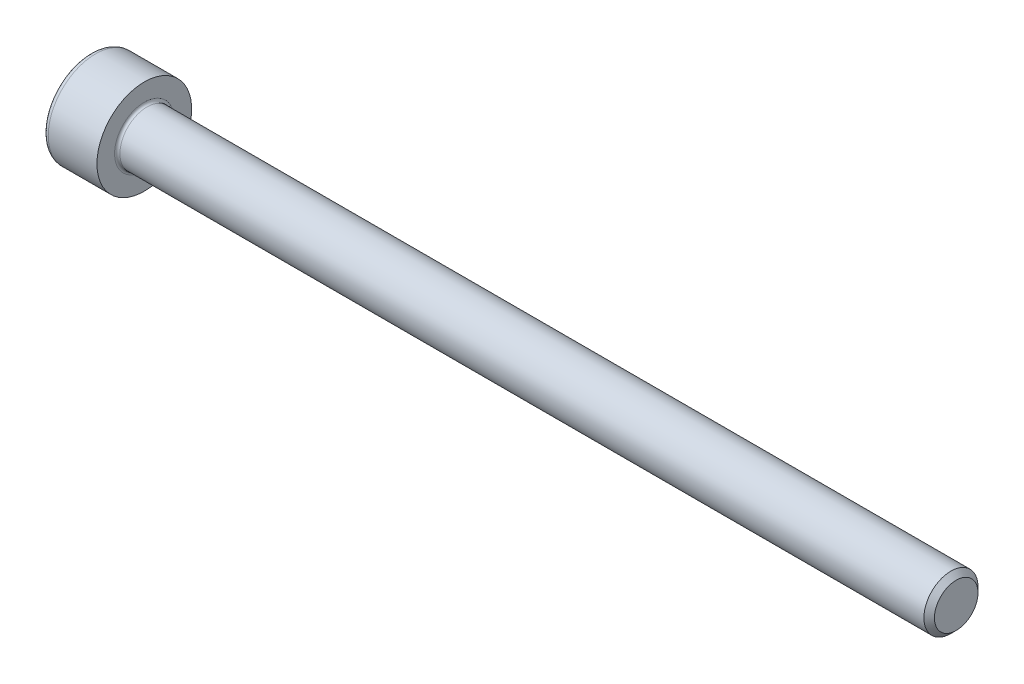
ISO-10303-21;
HEADER;
FILE_DESCRIPTION(('STEP AP214'),'2;1');
FILE_NAME('part.step','',(''),(''),'','','');
FILE_SCHEMA(('AUTOMOTIVE_DESIGN { 1 0 10303 214 1 1 1 1 }'));
ENDSEC;
DATA;
#1=APPLICATION_CONTEXT('core data for automotive mechanical design processes');
#2=APPLICATION_PROTOCOL_DEFINITION('international standard','automotive_design',2000,#1);
#3=PRODUCT_CONTEXT('',#1,'mechanical');
#4=PRODUCT('Part','Part','',(#3));
#5=PRODUCT_RELATED_PRODUCT_CATEGORY('part','',(#4));
#6=PRODUCT_DEFINITION_FORMATION('','',#4);
#7=PRODUCT_DEFINITION_CONTEXT('part definition',#1,'design');
#8=PRODUCT_DEFINITION('design','',#6,#7);
#9=PRODUCT_DEFINITION_SHAPE('','',#8);
#10=(LENGTH_UNIT() NAMED_UNIT(*) SI_UNIT(.MILLI.,.METRE.));
#11=(NAMED_UNIT(*) PLANE_ANGLE_UNIT() SI_UNIT($,.RADIAN.));
#12=(NAMED_UNIT(*) SI_UNIT($,.STERADIAN.) SOLID_ANGLE_UNIT());
#13=UNCERTAINTY_MEASURE_WITH_UNIT(LENGTH_MEASURE(1.E-05),#10,'distance_accuracy_value','');
#14=(GEOMETRIC_REPRESENTATION_CONTEXT(3) GLOBAL_UNCERTAINTY_ASSIGNED_CONTEXT((#13)) GLOBAL_UNIT_ASSIGNED_CONTEXT((#10,
#11,#12)) REPRESENTATION_CONTEXT('',''));
#15=CARTESIAN_POINT('',(0.,0.,0.));
#16=DIRECTION('',(0.,0.,1.));
#17=DIRECTION('',(1.,0.,0.));
#18=AXIS2_PLACEMENT_3D('',#15,#16,#17);
#19=CARTESIAN_POINT('',(0.,0.,0.));
#20=DIRECTION('',(-1.,0.,0.));
#21=DIRECTION('',(0.,0.,1.));
#22=AXIS2_PLACEMENT_3D('',#19,#20,#21);
#23=PLANE('',#22);
#24=DIRECTION('',(0.,-0.499999999999998,0.86602540378444));
#25=VECTOR('',#24,1.);
#26=CARTESIAN_POINT('',(0.,1.74359781295266,0.));
#27=LINE('',#26,#25);
#28=CARTESIAN_POINT('',(0.,1.74359781295266,0.));
#29=VERTEX_POINT('',#28);
#30=CARTESIAN_POINT('',(0.,0.871798906476332,1.51));
#31=VERTEX_POINT('',#30);
#32=EDGE_CURVE('E266',#29,#31,#27,.T.);
#33=ORIENTED_EDGE('',*,*,#32,.T.);
#34=DIRECTION('',(0.,1.,0.));
#35=VECTOR('',#34,1.);
#36=CARTESIAN_POINT('',(0.,-0.871798906476338,1.51));
#37=LINE('',#36,#35);
#38=CARTESIAN_POINT('',(0.,-0.871798906476338,1.51));
#39=VERTEX_POINT('',#38);
#40=EDGE_CURVE('E127',#39,#31,#37,.T.);
#41=ORIENTED_EDGE('',*,*,#40,.F.);
#42=DIRECTION('',(0.,-0.500000000000001,-0.866025403784438));
#43=VECTOR('',#42,1.);
#44=CARTESIAN_POINT('',(0.,-0.871798906476338,1.51));
#45=LINE('',#44,#43);
#46=CARTESIAN_POINT('',(0.,-1.74359781295267,0.));
#47=VERTEX_POINT('',#46);
#48=EDGE_CURVE('E269',#39,#47,#45,.T.);
#49=ORIENTED_EDGE('',*,*,#48,.T.);
#50=DIRECTION('',(0.,0.499999999999998,-0.86602540378444));
#51=VECTOR('',#50,1.);
#52=CARTESIAN_POINT('',(0.,-1.74359781295267,0.));
#53=LINE('',#52,#51);
#54=CARTESIAN_POINT('',(0.,-0.871798906476343,-1.51));
#55=VERTEX_POINT('',#54);
#56=EDGE_CURVE('E272',#47,#55,#53,.T.);
#57=ORIENTED_EDGE('',*,*,#56,.T.);
#58=DIRECTION('',(0.,-1.,0.));
#59=VECTOR('',#58,1.);
#60=CARTESIAN_POINT('',(0.,0.871798906476327,-1.51));
#61=LINE('',#60,#59);
#62=CARTESIAN_POINT('',(0.,0.871798906476327,-1.51));
#63=VERTEX_POINT('',#62);
#64=EDGE_CURVE('E275',#63,#55,#61,.T.);
#65=ORIENTED_EDGE('',*,*,#64,.F.);
#66=DIRECTION('',(0.,-0.500000000000001,-0.866025403784438));
#67=VECTOR('',#66,1.);
#68=CARTESIAN_POINT('',(0.,1.74359781295266,0.));
#69=LINE('',#68,#67);
#70=EDGE_CURVE('E122',#29,#63,#69,.T.);
#71=ORIENTED_EDGE('',*,*,#70,.F.);
#72=EDGE_LOOP('',(#33,#41,#49,#57,#65,#71));
#73=FACE_BOUND('',#72,.T.);
#74=CARTESIAN_POINT('',(0.,0.,0.));
#75=DIRECTION('',(-1.,0.,0.));
#76=DIRECTION('',(0.,0.,1.));
#77=AXIS2_PLACEMENT_3D('',#74,#75,#76);
#78=CIRCLE('',#77,3.1);
#79=CARTESIAN_POINT('',(0.,0.,3.1));
#80=VERTEX_POINT('',#79);
#81=EDGE_CURVE('E43',#80,#80,#78,.T.);
#82=ORIENTED_EDGE('',*,*,#81,.T.);
#83=EDGE_LOOP('',(#82));
#84=FACE_BOUND('',#83,.T.);
#85=ADVANCED_FACE('F35',(#73,#84),#23,.T.);
#86=CARTESIAN_POINT('',(-31.75,0.,0.));
#87=DIRECTION('',(-1.,0.,0.));
#88=DIRECTION('',(0.,0.,1.));
#89=AXIS2_PLACEMENT_3D('',#86,#87,#88);
#90=CYLINDRICAL_SURFACE('',#89,3.5);
#91=CARTESIAN_POINT('',(0.399999999999998,0.,0.));
#92=DIRECTION('',(-1.,0.,0.));
#93=DIRECTION('',(0.,0.,1.));
#94=AXIS2_PLACEMENT_3D('',#91,#92,#93);
#95=CIRCLE('',#94,3.5);
#96=CARTESIAN_POINT('',(0.399999999999998,0.,3.5));
#97=VERTEX_POINT('',#96);
#98=EDGE_CURVE('E11',#97,#97,#95,.F.);
#99=ORIENTED_EDGE('',*,*,#98,.T.);
#100=EDGE_LOOP('',(#99));
#101=FACE_BOUND('',#100,.T.);
#102=CARTESIAN_POINT('',(4.,0.,0.));
#103=DIRECTION('',(-1.,0.,0.));
#104=DIRECTION('',(0.,0.,1.));
#105=AXIS2_PLACEMENT_3D('',#102,#103,#104);
#106=CIRCLE('',#105,3.5);
#107=CARTESIAN_POINT('',(4.,0.,3.5));
#108=VERTEX_POINT('',#107);
#109=EDGE_CURVE('E145',#108,#108,#106,.T.);
#110=ORIENTED_EDGE('',*,*,#109,.T.);
#111=EDGE_LOOP('',(#110));
#112=FACE_BOUND('',#111,.T.);
#113=ADVANCED_FACE('F169',(#101,#112),#90,.T.);
#114=CARTESIAN_POINT('',(4.,3.5,0.));
#115=DIRECTION('',(1.,0.,0.));
#116=DIRECTION('',(0.,0.,-1.));
#117=AXIS2_PLACEMENT_3D('',#114,#115,#116);
#118=PLANE('',#117);
#119=CARTESIAN_POINT('',(4.,0.,0.));
#120=DIRECTION('',(1.,0.,0.));
#121=DIRECTION('',(0.,0.,-1.));
#122=AXIS2_PLACEMENT_3D('',#119,#120,#121);
#123=CIRCLE('',#122,2.19999999999999);
#124=CARTESIAN_POINT('',(4.,0.,-2.19999999999999));
#125=VERTEX_POINT('',#124);
#126=EDGE_CURVE('E148',#125,#125,#123,.F.);
#127=ORIENTED_EDGE('',*,*,#126,.T.);
#128=EDGE_LOOP('',(#127));
#129=FACE_BOUND('',#128,.T.);
#130=ORIENTED_EDGE('',*,*,#109,.F.);
#131=EDGE_LOOP('',(#130));
#132=FACE_BOUND('',#131,.T.);
#133=ADVANCED_FACE('F175',(#129,#132),#118,.T.);
#134=CARTESIAN_POINT('',(-31.75,0.,0.));
#135=DIRECTION('',(-1.,0.,0.));
#136=DIRECTION('',(0.,0.,1.));
#137=AXIS2_PLACEMENT_3D('',#134,#135,#136);
#138=CYLINDRICAL_SURFACE('',#137,1.99999999999999);
#139=CARTESIAN_POINT('',(4.2,0.,0.));
#140=DIRECTION('',(1.,0.,0.));
#141=DIRECTION('',(0.,0.,-1.));
#142=AXIS2_PLACEMENT_3D('',#139,#140,#141);
#143=CIRCLE('',#142,1.99999999999999);
#144=CARTESIAN_POINT('',(4.2,0.,-1.99999999999999));
#145=VERTEX_POINT('',#144);
#146=EDGE_CURVE('E151',#145,#145,#143,.T.);
#147=ORIENTED_EDGE('',*,*,#146,.T.);
#148=EDGE_LOOP('',(#147));
#149=FACE_BOUND('',#148,.T.);
#150=CARTESIAN_POINT('',(63.61,0.,0.));
#151=DIRECTION('',(-1.,0.,0.));
#152=DIRECTION('',(0.,0.,1.));
#153=AXIS2_PLACEMENT_3D('',#150,#151,#152);
#154=CIRCLE('',#153,1.99999999999998);
#155=CARTESIAN_POINT('',(63.61,0.,1.99999999999998));
#156=VERTEX_POINT('',#155);
#157=EDGE_CURVE('E142',#156,#156,#154,.T.);
#158=ORIENTED_EDGE('',*,*,#157,.T.);
#159=EDGE_LOOP('',(#158));
#160=FACE_BOUND('',#159,.T.);
#161=ADVANCED_FACE('F181',(#149,#160),#138,.T.);
#162=CARTESIAN_POINT('',(64.,0.,0.));
#163=DIRECTION('',(-1.,0.,0.));
#164=DIRECTION('',(0.,0.,1.));
#165=AXIS2_PLACEMENT_3D('',#162,#163,#164);
#166=CONICAL_SURFACE('',#165,1.61,0.785398163397426);
#167=ORIENTED_EDGE('',*,*,#157,.F.);
#168=EDGE_LOOP('',(#167));
#169=FACE_BOUND('',#168,.T.);
#170=CARTESIAN_POINT('',(64.,0.,0.));
#171=DIRECTION('',(-1.,0.,0.));
#172=DIRECTION('',(0.,0.,1.));
#173=AXIS2_PLACEMENT_3D('',#170,#171,#172);
#174=CIRCLE('',#173,1.61);
#175=CARTESIAN_POINT('',(64.,0.,1.61));
#176=VERTEX_POINT('',#175);
#177=EDGE_CURVE('E138',#176,#176,#174,.T.);
#178=ORIENTED_EDGE('',*,*,#177,.T.);
#179=EDGE_LOOP('',(#178));
#180=FACE_BOUND('',#179,.T.);
#181=ADVANCED_FACE('F185',(#169,#180),#166,.T.);
#182=CARTESIAN_POINT('',(64.,1.61,0.));
#183=DIRECTION('',(1.,0.,0.));
#184=DIRECTION('',(0.,0.,-1.));
#185=AXIS2_PLACEMENT_3D('',#182,#183,#184);
#186=PLANE('',#185);
#187=ORIENTED_EDGE('',*,*,#177,.F.);
#188=EDGE_LOOP('',(#187));
#189=FACE_BOUND('',#188,.T.);
#190=ADVANCED_FACE('F165',(#189),#186,.T.);
#191=CARTESIAN_POINT('',(4.2,0.,0.));
#192=DIRECTION('',(1.,0.,0.));
#193=DIRECTION('',(0.,0.,-1.));
#194=AXIS2_PLACEMENT_3D('',#191,#192,#193);
#195=TOROIDAL_SURFACE('',#194,2.19999999999999,0.2);
#196=ORIENTED_EDGE('',*,*,#146,.F.);
#197=EDGE_LOOP('',(#196));
#198=FACE_BOUND('',#197,.T.);
#199=ORIENTED_EDGE('',*,*,#126,.F.);
#200=EDGE_LOOP('',(#199));
#201=FACE_BOUND('',#200,.T.);
#202=ADVANCED_FACE('F158',(#198,#201),#195,.F.);
#203=CARTESIAN_POINT('',(0.399999999999998,0.,0.));
#204=DIRECTION('',(-1.,0.,0.));
#205=DIRECTION('',(0.,0.,1.));
#206=AXIS2_PLACEMENT_3D('',#203,#204,#205);
#207=TOROIDAL_SURFACE('',#206,3.1,0.4);
#208=ORIENTED_EDGE('',*,*,#98,.F.);
#209=EDGE_LOOP('',(#208));
#210=FACE_BOUND('',#209,.T.);
#211=ORIENTED_EDGE('',*,*,#81,.F.);
#212=EDGE_LOOP('',(#211));
#213=FACE_BOUND('',#212,.T.);
#214=ADVANCED_FACE('F37',(#210,#213),#207,.T.);
#215=CARTESIAN_POINT('',(2.,1.74359781295266,0.));
#216=DIRECTION('',(0.,-0.86602540378444,-0.499999999999998));
#217=DIRECTION('',(0.,0.499999999999998,-0.86602540378444));
#218=AXIS2_PLACEMENT_3D('',#215,#216,#217);
#219=PLANE('',#218);
#220=ORIENTED_EDGE('',*,*,#32,.F.);
#221=DIRECTION('',(-1.,0.,0.));
#222=VECTOR('',#221,1.);
#223=CARTESIAN_POINT('',(2.,1.74359781295266,0.));
#224=LINE('',#223,#222);
#225=CARTESIAN_POINT('',(2.,1.74359781295266,0.));
#226=VERTEX_POINT('',#225);
#227=EDGE_CURVE('E265',#226,#29,#224,.T.);
#228=ORIENTED_EDGE('',*,*,#227,.F.);
#229=DIRECTION('',(0.,-0.499999999999998,0.86602540378444));
#230=VECTOR('',#229,1.);
#231=CARTESIAN_POINT('',(2.,1.74359781295266,0.));
#232=LINE('',#231,#230);
#233=CARTESIAN_POINT('',(2.,1.3076983597145,0.754999999999998));
#234=VERTEX_POINT('',#233);
#235=EDGE_CURVE('E50',#226,#234,#232,.T.);
#236=ORIENTED_EDGE('',*,*,#235,.T.);
#237=CARTESIAN_POINT('',(2.,0.871798906476332,1.51));
#238=VERTEX_POINT('',#237);
#239=EDGE_CURVE('E108',#234,#238,#232,.T.);
#240=ORIENTED_EDGE('',*,*,#239,.T.);
#241=DIRECTION('',(-1.,0.,0.));
#242=VECTOR('',#241,1.);
#243=CARTESIAN_POINT('',(2.,0.871798906476332,1.51));
#244=LINE('',#243,#242);
#245=EDGE_CURVE('E120',#238,#31,#244,.T.);
#246=ORIENTED_EDGE('',*,*,#245,.T.);
#247=EDGE_LOOP('',(#220,#228,#236,#240,#246));
#248=FACE_BOUND('',#247,.T.);
#249=ADVANCED_FACE('F119',(#248),#219,.T.);
#250=CARTESIAN_POINT('',(2.,-0.871798906476338,1.51));
#251=DIRECTION('',(0.,0.,1.));
#252=DIRECTION('',(0.,-1.,0.));
#253=AXIS2_PLACEMENT_3D('',#250,#251,#252);
#254=PLANE('',#253);
#255=ORIENTED_EDGE('',*,*,#40,.T.);
#256=ORIENTED_EDGE('',*,*,#245,.F.);
#257=DIRECTION('',(0.,1.,0.));
#258=VECTOR('',#257,1.);
#259=CARTESIAN_POINT('',(2.,-0.871798906476338,1.51));
#260=LINE('',#259,#258);
#261=CARTESIAN_POINT('',(2.,0.,1.51));
#262=VERTEX_POINT('',#261);
#263=EDGE_CURVE('E106',#262,#238,#260,.T.);
#264=ORIENTED_EDGE('',*,*,#263,.F.);
#265=CARTESIAN_POINT('',(2.,-0.871798906476338,1.51));
#266=VERTEX_POINT('',#265);
#267=EDGE_CURVE('E116',#266,#262,#260,.T.);
#268=ORIENTED_EDGE('',*,*,#267,.F.);
#269=DIRECTION('',(-1.,0.,0.));
#270=VECTOR('',#269,1.);
#271=CARTESIAN_POINT('',(2.,-0.871798906476338,1.51));
#272=LINE('',#271,#270);
#273=EDGE_CURVE('E129',#266,#39,#272,.T.);
#274=ORIENTED_EDGE('',*,*,#273,.T.);
#275=EDGE_LOOP('',(#255,#256,#264,#268,#274));
#276=FACE_BOUND('',#275,.T.);
#277=ADVANCED_FACE('F124',(#276),#254,.F.);
#278=CARTESIAN_POINT('',(2.,-0.871798906476338,1.51));
#279=DIRECTION('',(0.,0.866025403784438,-0.500000000000001));
#280=DIRECTION('',(0.,0.500000000000001,0.866025403784438));
#281=AXIS2_PLACEMENT_3D('',#278,#279,#280);
#282=PLANE('',#281);
#283=ORIENTED_EDGE('',*,*,#48,.F.);
#284=ORIENTED_EDGE('',*,*,#273,.F.);
#285=DIRECTION('',(0.,-0.500000000000001,-0.866025403784438));
#286=VECTOR('',#285,1.);
#287=CARTESIAN_POINT('',(2.,-0.871798906476338,1.51));
#288=LINE('',#287,#286);
#289=CARTESIAN_POINT('',(2.,-1.3076983597145,0.755000000000004));
#290=VERTEX_POINT('',#289);
#291=EDGE_CURVE('E246',#266,#290,#288,.T.);
#292=ORIENTED_EDGE('',*,*,#291,.T.);
#293=CARTESIAN_POINT('',(2.,-1.74359781295267,0.));
#294=VERTEX_POINT('',#293);
#295=EDGE_CURVE('E248',#290,#294,#288,.T.);
#296=ORIENTED_EDGE('',*,*,#295,.T.);
#297=DIRECTION('',(-1.,0.,0.));
#298=VECTOR('',#297,1.);
#299=CARTESIAN_POINT('',(2.,-1.74359781295267,0.));
#300=LINE('',#299,#298);
#301=EDGE_CURVE('E134',#294,#47,#300,.T.);
#302=ORIENTED_EDGE('',*,*,#301,.T.);
#303=EDGE_LOOP('',(#283,#284,#292,#296,#302));
#304=FACE_BOUND('',#303,.T.);
#305=ADVANCED_FACE('F198',(#304),#282,.T.);
#306=CARTESIAN_POINT('',(2.,-1.74359781295267,0.));
#307=DIRECTION('',(0.,0.86602540378444,0.499999999999998));
#308=DIRECTION('',(0.,-0.499999999999998,0.86602540378444));
#309=AXIS2_PLACEMENT_3D('',#306,#307,#308);
#310=PLANE('',#309);
#311=ORIENTED_EDGE('',*,*,#56,.F.);
#312=ORIENTED_EDGE('',*,*,#301,.F.);
#313=DIRECTION('',(0.,0.499999999999998,-0.86602540378444));
#314=VECTOR('',#313,1.);
#315=CARTESIAN_POINT('',(2.,-1.74359781295267,0.));
#316=LINE('',#315,#314);
#317=CARTESIAN_POINT('',(2.,-1.30769835971451,-0.755));
#318=VERTEX_POINT('',#317);
#319=EDGE_CURVE('E251',#294,#318,#316,.T.);
#320=ORIENTED_EDGE('',*,*,#319,.T.);
#321=CARTESIAN_POINT('',(2.,-0.871798906476343,-1.51));
#322=VERTEX_POINT('',#321);
#323=EDGE_CURVE('E255',#318,#322,#316,.T.);
#324=ORIENTED_EDGE('',*,*,#323,.T.);
#325=DIRECTION('',(-1.,0.,0.));
#326=VECTOR('',#325,1.);
#327=CARTESIAN_POINT('',(2.,-0.871798906476343,-1.51));
#328=LINE('',#327,#326);
#329=EDGE_CURVE('E284',#322,#55,#328,.T.);
#330=ORIENTED_EDGE('',*,*,#329,.T.);
#331=EDGE_LOOP('',(#311,#312,#320,#324,#330));
#332=FACE_BOUND('',#331,.T.);
#333=ADVANCED_FACE('F201',(#332),#310,.T.);
#334=CARTESIAN_POINT('',(2.,0.871798906476327,-1.51));
#335=DIRECTION('',(0.,0.,-1.));
#336=DIRECTION('',(0.,1.,0.));
#337=AXIS2_PLACEMENT_3D('',#334,#335,#336);
#338=PLANE('',#337);
#339=ORIENTED_EDGE('',*,*,#64,.T.);
#340=ORIENTED_EDGE('',*,*,#329,.F.);
#341=DIRECTION('',(0.,-1.,0.));
#342=VECTOR('',#341,1.);
#343=CARTESIAN_POINT('',(2.,0.871798906476327,-1.51));
#344=LINE('',#343,#342);
#345=CARTESIAN_POINT('',(2.,0.,-1.51));
#346=VERTEX_POINT('',#345);
#347=EDGE_CURVE('E259',#346,#322,#344,.T.);
#348=ORIENTED_EDGE('',*,*,#347,.F.);
#349=CARTESIAN_POINT('',(2.,0.871798906476327,-1.51));
#350=VERTEX_POINT('',#349);
#351=EDGE_CURVE('E260',#350,#346,#344,.T.);
#352=ORIENTED_EDGE('',*,*,#351,.F.);
#353=DIRECTION('',(-1.,0.,0.));
#354=VECTOR('',#353,1.);
#355=CARTESIAN_POINT('',(2.,0.871798906476327,-1.51));
#356=LINE('',#355,#354);
#357=EDGE_CURVE('E281',#350,#63,#356,.T.);
#358=ORIENTED_EDGE('',*,*,#357,.T.);
#359=EDGE_LOOP('',(#339,#340,#348,#352,#358));
#360=FACE_BOUND('',#359,.T.);
#361=ADVANCED_FACE('F205',(#360),#338,.F.);
#362=CARTESIAN_POINT('',(2.,1.74359781295266,0.));
#363=DIRECTION('',(0.,0.866025403784438,-0.500000000000001));
#364=DIRECTION('',(0.,0.500000000000001,0.866025403784438));
#365=AXIS2_PLACEMENT_3D('',#362,#363,#364);
#366=PLANE('',#365);
#367=ORIENTED_EDGE('',*,*,#70,.T.);
#368=ORIENTED_EDGE('',*,*,#357,.F.);
#369=DIRECTION('',(0.,-0.500000000000001,-0.866025403784438));
#370=VECTOR('',#369,1.);
#371=CARTESIAN_POINT('',(2.,1.74359781295266,0.));
#372=LINE('',#371,#370);
#373=CARTESIAN_POINT('',(2.,1.3076983597145,-0.754999999999999));
#374=VERTEX_POINT('',#373);
#375=EDGE_CURVE('E263',#374,#350,#372,.T.);
#376=ORIENTED_EDGE('',*,*,#375,.F.);
#377=EDGE_CURVE('E237',#226,#374,#372,.T.);
#378=ORIENTED_EDGE('',*,*,#377,.F.);
#379=ORIENTED_EDGE('',*,*,#227,.T.);
#380=EDGE_LOOP('',(#367,#368,#376,#378,#379));
#381=FACE_BOUND('',#380,.T.);
#382=ADVANCED_FACE('F209',(#381),#366,.F.);
#383=CARTESIAN_POINT('',(2.,0.871798906476331,1.51));
#384=DIRECTION('',(-1.,0.,0.));
#385=DIRECTION('',(0.,0.,1.));
#386=AXIS2_PLACEMENT_3D('',#383,#384,#385);
#387=PLANE('',#386);
#388=CARTESIAN_POINT('',(2.,0.,0.));
#389=DIRECTION('',(-1.,0.,0.));
#390=DIRECTION('',(0.,0.,1.));
#391=AXIS2_PLACEMENT_3D('',#388,#389,#390);
#392=CIRCLE('',#391,1.51);
#393=EDGE_CURVE('E128',#290,#262,#392,.T.);
#394=ORIENTED_EDGE('',*,*,#393,.F.);
#395=ORIENTED_EDGE('',*,*,#291,.F.);
#396=ORIENTED_EDGE('',*,*,#267,.T.);
#397=EDGE_LOOP('',(#394,#395,#396));
#398=FACE_BOUND('',#397,.T.);
#399=ADVANCED_FACE('F213',(#398),#387,.T.);
#400=EDGE_CURVE('E132',#318,#290,#392,.T.);
#401=ORIENTED_EDGE('',*,*,#400,.F.);
#402=ORIENTED_EDGE('',*,*,#319,.F.);
#403=ORIENTED_EDGE('',*,*,#295,.F.);
#404=EDGE_LOOP('',(#401,#402,#403));
#405=FACE_BOUND('',#404,.T.);
#406=ADVANCED_FACE('F216',(#405),#387,.T.);
#407=EDGE_CURVE('E290',#346,#318,#392,.T.);
#408=ORIENTED_EDGE('',*,*,#407,.F.);
#409=ORIENTED_EDGE('',*,*,#347,.T.);
#410=ORIENTED_EDGE('',*,*,#323,.F.);
#411=EDGE_LOOP('',(#408,#409,#410));
#412=FACE_BOUND('',#411,.T.);
#413=ADVANCED_FACE('F221',(#412),#387,.T.);
#414=EDGE_CURVE('E240',#374,#346,#392,.T.);
#415=ORIENTED_EDGE('',*,*,#414,.F.);
#416=ORIENTED_EDGE('',*,*,#375,.T.);
#417=ORIENTED_EDGE('',*,*,#351,.T.);
#418=EDGE_LOOP('',(#415,#416,#417));
#419=FACE_BOUND('',#418,.T.);
#420=ADVANCED_FACE('F228',(#419),#387,.T.);
#421=EDGE_CURVE('E139',#234,#374,#392,.T.);
#422=ORIENTED_EDGE('',*,*,#421,.F.);
#423=ORIENTED_EDGE('',*,*,#235,.F.);
#424=ORIENTED_EDGE('',*,*,#377,.T.);
#425=EDGE_LOOP('',(#422,#423,#424));
#426=FACE_BOUND('',#425,.T.);
#427=ADVANCED_FACE('F224',(#426),#387,.T.);
#428=EDGE_CURVE('E111',#262,#234,#392,.T.);
#429=ORIENTED_EDGE('',*,*,#428,.F.);
#430=ORIENTED_EDGE('',*,*,#263,.T.);
#431=ORIENTED_EDGE('',*,*,#239,.F.);
#432=EDGE_LOOP('',(#429,#430,#431));
#433=FACE_BOUND('',#432,.T.);
#434=ADVANCED_FACE('F107',(#433),#387,.T.);
#435=CARTESIAN_POINT('',(2.,0.,0.));
#436=DIRECTION('',(-1.,0.,0.));
#437=DIRECTION('',(0.,0.,1.));
#438=AXIS2_PLACEMENT_3D('',#435,#436,#437);
#439=CONICAL_SURFACE('',#438,1.51,1.04719755119659);
#440=CARTESIAN_POINT('',(2.87179890647635,0.,0.));
#441=VERTEX_POINT('',#440);
#442=VERTEX_LOOP('',#441);
#443=FACE_BOUND('',#442,.T.);
#444=ORIENTED_EDGE('',*,*,#428,.T.);
#445=ORIENTED_EDGE('',*,*,#421,.T.);
#446=ORIENTED_EDGE('',*,*,#414,.T.);
#447=ORIENTED_EDGE('',*,*,#407,.T.);
#448=ORIENTED_EDGE('',*,*,#400,.T.);
#449=ORIENTED_EDGE('',*,*,#393,.T.);
#450=EDGE_LOOP('',(#444,#445,#446,#447,#448,#449));
#451=FACE_BOUND('',#450,.T.);
#452=ADVANCED_FACE('F193',(#443,#451),#439,.F.);
#453=CLOSED_SHELL('',(#85,#113,#133,#161,#181,#190,#202,#214,#249,#277,#305,#333,#361,#382,#399,
#406,#413,#420,#427,#434,#452));
#454=MANIFOLD_SOLID_BREP('B2',#453);
#455=ADVANCED_BREP_SHAPE_REPRESENTATION('',(#18,#454),#14);
#456=SHAPE_DEFINITION_REPRESENTATION(#9,#455);
ENDSEC;
END-ISO-10303-21;
